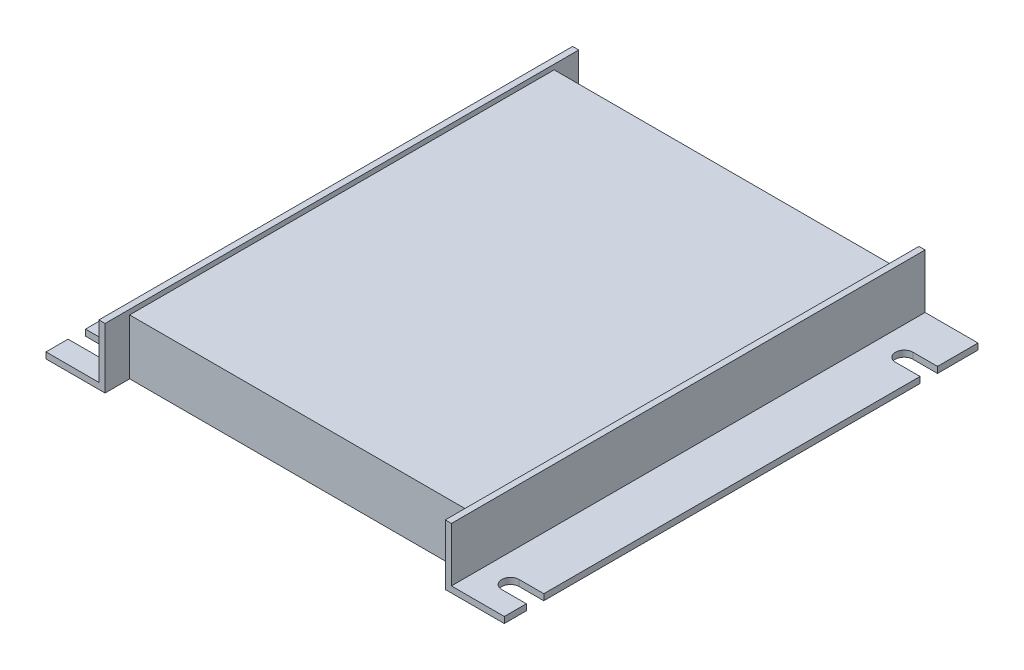
ISO-10303-21;
HEADER;
FILE_DESCRIPTION(('STEP AP214'),'2;1');
FILE_NAME('part.step','',(''),(''),'','','');
FILE_SCHEMA(('AUTOMOTIVE_DESIGN { 1 0 10303 214 1 1 1 1 }'));
ENDSEC;
DATA;
#1=APPLICATION_CONTEXT('core data for automotive mechanical design processes');
#2=APPLICATION_PROTOCOL_DEFINITION('international standard','automotive_design',2000,#1);
#3=PRODUCT_CONTEXT('',#1,'mechanical');
#4=PRODUCT('Part','Part','',(#3));
#5=PRODUCT_RELATED_PRODUCT_CATEGORY('part','',(#4));
#6=PRODUCT_DEFINITION_FORMATION('','',#4);
#7=PRODUCT_DEFINITION_CONTEXT('part definition',#1,'design');
#8=PRODUCT_DEFINITION('design','',#6,#7);
#9=PRODUCT_DEFINITION_SHAPE('','',#8);
#10=(LENGTH_UNIT() NAMED_UNIT(*) SI_UNIT(.MILLI.,.METRE.));
#11=(NAMED_UNIT(*) PLANE_ANGLE_UNIT() SI_UNIT($,.RADIAN.));
#12=(NAMED_UNIT(*) SI_UNIT($,.STERADIAN.) SOLID_ANGLE_UNIT());
#13=UNCERTAINTY_MEASURE_WITH_UNIT(LENGTH_MEASURE(1.E-05),#10,'distance_accuracy_value','');
#14=(GEOMETRIC_REPRESENTATION_CONTEXT(3) GLOBAL_UNCERTAINTY_ASSIGNED_CONTEXT((#13)) GLOBAL_UNIT_ASSIGNED_CONTEXT((#10,
#11,#12)) REPRESENTATION_CONTEXT('',''));
#15=CARTESIAN_POINT('',(0.,0.,0.));
#16=DIRECTION('',(0.,0.,1.));
#17=DIRECTION('',(1.,0.,0.));
#18=AXIS2_PLACEMENT_3D('',#15,#16,#17);
#19=CARTESIAN_POINT('',(0.,1.5875,0.));
#20=DIRECTION('',(1.,0.,0.));
#21=DIRECTION('',(0.,0.,-1.));
#22=AXIS2_PLACEMENT_3D('',#19,#20,#21);
#23=PLANE('',#22);
#24=DIRECTION('',(0.,0.,1.));
#25=VECTOR('',#24,1.);
#26=CARTESIAN_POINT('',(0.,0.,0.));
#27=LINE('',#26,#25);
#28=CARTESIAN_POINT('',(0.,0.,-107.2896));
#29=VERTEX_POINT('',#28);
#30=CARTESIAN_POINT('',(0.,0.,-10.1854));
#31=VERTEX_POINT('',#30);
#32=EDGE_CURVE('E339',#29,#31,#27,.T.);
#33=ORIENTED_EDGE('',*,*,#32,.T.);
#34=DIRECTION('',(0.,1.,0.));
#35=VECTOR('',#34,1.);
#36=CARTESIAN_POINT('',(0.,1.5875,-10.1854));
#37=LINE('',#36,#35);
#38=CARTESIAN_POINT('',(0.,1.5875,-10.1854));
#39=VERTEX_POINT('',#38);
#40=EDGE_CURVE('E438',#31,#39,#37,.T.);
#41=ORIENTED_EDGE('',*,*,#40,.T.);
#42=DIRECTION('',(0.,0.,1.));
#43=VECTOR('',#42,1.);
#44=CARTESIAN_POINT('',(0.,1.5875,0.));
#45=LINE('',#44,#43);
#46=CARTESIAN_POINT('',(0.,1.5875,-107.2896));
#47=VERTEX_POINT('',#46);
#48=EDGE_CURVE('E355',#47,#39,#45,.T.);
#49=ORIENTED_EDGE('',*,*,#48,.F.);
#50=DIRECTION('',(0.,-1.,0.));
#51=VECTOR('',#50,1.);
#52=CARTESIAN_POINT('',(0.,1.5875,-107.2896));
#53=LINE('',#52,#51);
#54=EDGE_CURVE('E412',#47,#29,#53,.T.);
#55=ORIENTED_EDGE('',*,*,#54,.T.);
#56=EDGE_LOOP('',(#33,#41,#49,#55));
#57=FACE_BOUND('',#56,.T.);
#58=ADVANCED_FACE('F39',(#57),#23,.F.);
#59=CARTESIAN_POINT('',(0.,1.5875,0.));
#60=DIRECTION('',(0.,0.,-1.));
#61=DIRECTION('',(-1.,0.,0.));
#62=AXIS2_PLACEMENT_3D('',#59,#60,#61);
#63=PLANE('',#62);
#64=DIRECTION('',(1.,0.,0.));
#65=VECTOR('',#64,1.);
#66=CARTESIAN_POINT('',(0.,0.,0.));
#67=LINE('',#66,#65);
#68=CARTESIAN_POINT('',(0.,0.,0.));
#69=VERTEX_POINT('',#68);
#70=CARTESIAN_POINT('',(15.24,0.,0.));
#71=VERTEX_POINT('',#70);
#72=EDGE_CURVE('E330',#69,#71,#67,.T.);
#73=ORIENTED_EDGE('',*,*,#72,.T.);
#74=DIRECTION('',(0.,-1.,0.));
#75=VECTOR('',#74,1.);
#76=CARTESIAN_POINT('',(15.24,15.5575,0.));
#77=LINE('',#76,#75);
#78=CARTESIAN_POINT('',(15.24,15.5575,0.));
#79=VERTEX_POINT('',#78);
#80=EDGE_CURVE('E374',#79,#71,#77,.T.);
#81=ORIENTED_EDGE('',*,*,#80,.F.);
#82=DIRECTION('',(1.,0.,0.));
#83=VECTOR('',#82,1.);
#84=CARTESIAN_POINT('',(15.24,15.5575,0.));
#85=LINE('',#84,#83);
#86=CARTESIAN_POINT('',(13.6525,15.5575,0.));
#87=VERTEX_POINT('',#86);
#88=EDGE_CURVE('E384',#87,#79,#85,.T.);
#89=ORIENTED_EDGE('',*,*,#88,.F.);
#90=DIRECTION('',(0.,-1.,0.));
#91=VECTOR('',#90,1.);
#92=CARTESIAN_POINT('',(13.6525,15.5575,0.));
#93=LINE('',#92,#91);
#94=CARTESIAN_POINT('',(13.6525,1.5875,0.));
#95=VERTEX_POINT('',#94);
#96=EDGE_CURVE('E371',#87,#95,#93,.T.);
#97=ORIENTED_EDGE('',*,*,#96,.T.);
#98=DIRECTION('',(1.,0.,0.));
#99=VECTOR('',#98,1.);
#100=CARTESIAN_POINT('',(0.,1.5875,0.));
#101=LINE('',#100,#99);
#102=CARTESIAN_POINT('',(0.,1.5875,0.));
#103=VERTEX_POINT('',#102);
#104=EDGE_CURVE('E348',#103,#95,#101,.T.);
#105=ORIENTED_EDGE('',*,*,#104,.F.);
#106=DIRECTION('',(0.,-1.,0.));
#107=VECTOR('',#106,1.);
#108=CARTESIAN_POINT('',(0.,1.5875,0.));
#109=LINE('',#108,#107);
#110=EDGE_CURVE('E301',#103,#69,#109,.T.);
#111=ORIENTED_EDGE('',*,*,#110,.T.);
#112=EDGE_LOOP('',(#73,#81,#89,#97,#105,#111));
#113=FACE_BOUND('',#112,.T.);
#114=ADVANCED_FACE('F530',(#113),#63,.F.);
#115=CARTESIAN_POINT('',(118.26875,1.5875,0.));
#116=DIRECTION('',(-1.,0.,0.));
#117=DIRECTION('',(0.,0.,1.));
#118=AXIS2_PLACEMENT_3D('',#115,#116,#117);
#119=PLANE('',#118);
#120=DIRECTION('',(0.,0.,-1.));
#121=VECTOR('',#120,1.);
#122=CARTESIAN_POINT('',(118.26875,1.5875,0.));
#123=LINE('',#122,#121);
#124=CARTESIAN_POINT('',(118.26875,1.5875,-111.7854));
#125=VERTEX_POINT('',#124);
#126=CARTESIAN_POINT('',(118.26875,1.5875,-122.2375));
#127=VERTEX_POINT('',#126);
#128=EDGE_CURVE('E326',#125,#127,#123,.T.);
#129=ORIENTED_EDGE('',*,*,#128,.F.);
#130=DIRECTION('',(0.,-1.,0.));
#131=VECTOR('',#130,1.);
#132=CARTESIAN_POINT('',(118.26875,1.5875,-111.7854));
#133=LINE('',#132,#131);
#134=CARTESIAN_POINT('',(118.26875,0.,-111.7854));
#135=VERTEX_POINT('',#134);
#136=EDGE_CURVE('E316',#125,#135,#133,.T.);
#137=ORIENTED_EDGE('',*,*,#136,.T.);
#138=DIRECTION('',(0.,0.,-1.));
#139=VECTOR('',#138,1.);
#140=CARTESIAN_POINT('',(118.26875,0.,0.));
#141=LINE('',#140,#139);
#142=CARTESIAN_POINT('',(118.26875,0.,-122.2375));
#143=VERTEX_POINT('',#142);
#144=EDGE_CURVE('E289',#135,#143,#141,.T.);
#145=ORIENTED_EDGE('',*,*,#144,.T.);
#146=DIRECTION('',(0.,-1.,0.));
#147=VECTOR('',#146,1.);
#148=CARTESIAN_POINT('',(118.26875,1.5875,-122.2375));
#149=LINE('',#148,#147);
#150=EDGE_CURVE('E294',#127,#143,#149,.T.);
#151=ORIENTED_EDGE('',*,*,#150,.F.);
#152=EDGE_LOOP('',(#129,#137,#145,#151));
#153=FACE_BOUND('',#152,.T.);
#154=ADVANCED_FACE('F324',(#153),#119,.F.);
#155=CARTESIAN_POINT('',(118.26875,0.,-10.1854));
#156=VERTEX_POINT('',#155);
#157=CARTESIAN_POINT('',(118.26875,0.,-107.2896));
#158=VERTEX_POINT('',#157);
#159=EDGE_CURVE('E287',#156,#158,#141,.T.);
#160=ORIENTED_EDGE('',*,*,#159,.T.);
#161=DIRECTION('',(0.,1.,0.));
#162=VECTOR('',#161,1.);
#163=CARTESIAN_POINT('',(118.26875,1.5875,-107.2896));
#164=LINE('',#163,#162);
#165=CARTESIAN_POINT('',(118.26875,1.5875,-107.2896));
#166=VERTEX_POINT('',#165);
#167=EDGE_CURVE('E62',#158,#166,#164,.T.);
#168=ORIENTED_EDGE('',*,*,#167,.T.);
#169=CARTESIAN_POINT('',(118.26875,1.5875,-10.1854));
#170=VERTEX_POINT('',#169);
#171=EDGE_CURVE('E347',#170,#166,#123,.T.);
#172=ORIENTED_EDGE('',*,*,#171,.F.);
#173=DIRECTION('',(0.,-1.,0.));
#174=VECTOR('',#173,1.);
#175=CARTESIAN_POINT('',(118.26875,1.5875,-10.1854));
#176=LINE('',#175,#174);
#177=EDGE_CURVE('E432',#170,#156,#176,.T.);
#178=ORIENTED_EDGE('',*,*,#177,.T.);
#179=EDGE_LOOP('',(#160,#168,#172,#178));
#180=FACE_BOUND('',#179,.T.);
#181=ADVANCED_FACE('F516',(#180),#119,.F.);
#182=CARTESIAN_POINT('',(0.,1.5875,-122.2375));
#183=DIRECTION('',(0.,0.,1.));
#184=DIRECTION('',(1.,0.,0.));
#185=AXIS2_PLACEMENT_3D('',#182,#183,#184);
#186=PLANE('',#185);
#187=DIRECTION('',(0.,-1.,0.));
#188=VECTOR('',#187,1.);
#189=CARTESIAN_POINT('',(15.24,15.5575,-122.2375));
#190=LINE('',#189,#188);
#191=CARTESIAN_POINT('',(15.24,15.5575,-122.2375));
#192=VERTEX_POINT('',#191);
#193=CARTESIAN_POINT('',(15.24,0.,-122.2375));
#194=VERTEX_POINT('',#193);
#195=EDGE_CURVE('E376',#192,#194,#190,.T.);
#196=ORIENTED_EDGE('',*,*,#195,.T.);
#197=DIRECTION('',(-1.,0.,0.));
#198=VECTOR('',#197,1.);
#199=CARTESIAN_POINT('',(0.,0.,-122.2375));
#200=LINE('',#199,#198);
#201=CARTESIAN_POINT('',(0.,0.,-122.2375));
#202=VERTEX_POINT('',#201);
#203=EDGE_CURVE('E274',#194,#202,#200,.T.);
#204=ORIENTED_EDGE('',*,*,#203,.T.);
#205=DIRECTION('',(0.,-1.,0.));
#206=VECTOR('',#205,1.);
#207=CARTESIAN_POINT('',(0.,1.5875,-122.2375));
#208=LINE('',#207,#206);
#209=CARTESIAN_POINT('',(0.,1.5875,-122.2375));
#210=VERTEX_POINT('',#209);
#211=EDGE_CURVE('E292',#210,#202,#208,.T.);
#212=ORIENTED_EDGE('',*,*,#211,.F.);
#213=DIRECTION('',(-1.,0.,0.));
#214=VECTOR('',#213,1.);
#215=CARTESIAN_POINT('',(0.,1.5875,-122.2375));
#216=LINE('',#215,#214);
#217=CARTESIAN_POINT('',(13.6525,1.5875,-122.2375));
#218=VERTEX_POINT('',#217);
#219=EDGE_CURVE('E343',#218,#210,#216,.T.);
#220=ORIENTED_EDGE('',*,*,#219,.F.);
#221=DIRECTION('',(0.,-1.,0.));
#222=VECTOR('',#221,1.);
#223=CARTESIAN_POINT('',(13.6525,15.5575,-122.2375));
#224=LINE('',#223,#222);
#225=CARTESIAN_POINT('',(13.6525,15.5575,-122.2375));
#226=VERTEX_POINT('',#225);
#227=EDGE_CURVE('E369',#226,#218,#224,.T.);
#228=ORIENTED_EDGE('',*,*,#227,.F.);
#229=DIRECTION('',(-1.,0.,0.));
#230=VECTOR('',#229,1.);
#231=CARTESIAN_POINT('',(13.6525,15.5575,-122.2375));
#232=LINE('',#231,#230);
#233=EDGE_CURVE('E381',#192,#226,#232,.T.);
#234=ORIENTED_EDGE('',*,*,#233,.F.);
#235=EDGE_LOOP('',(#196,#204,#212,#220,#228,#234));
#236=FACE_BOUND('',#235,.T.);
#237=ADVANCED_FACE('F539',(#236),#186,.F.);
#238=CARTESIAN_POINT('',(0.,0.,-111.7854));
#239=VERTEX_POINT('',#238);
#240=EDGE_CURVE('E277',#202,#239,#27,.T.);
#241=ORIENTED_EDGE('',*,*,#240,.T.);
#242=DIRECTION('',(0.,1.,0.));
#243=VECTOR('',#242,1.);
#244=CARTESIAN_POINT('',(0.,1.5875,-111.7854));
#245=LINE('',#244,#243);
#246=CARTESIAN_POINT('',(0.,1.5875,-111.7854));
#247=VERTEX_POINT('',#246);
#248=EDGE_CURVE('E402',#239,#247,#245,.T.);
#249=ORIENTED_EDGE('',*,*,#248,.T.);
#250=EDGE_CURVE('E352',#210,#247,#45,.T.);
#251=ORIENTED_EDGE('',*,*,#250,.F.);
#252=ORIENTED_EDGE('',*,*,#211,.T.);
#253=EDGE_LOOP('',(#241,#249,#251,#252));
#254=FACE_BOUND('',#253,.T.);
#255=ADVANCED_FACE('F532',(#254),#23,.F.);
#256=CARTESIAN_POINT('',(0.,1.5875,0.));
#257=DIRECTION('',(0.,-1.,0.));
#258=DIRECTION('',(0.,0.,-1.));
#259=AXIS2_PLACEMENT_3D('',#256,#257,#258);
#260=PLANE('',#259);
#261=CARTESIAN_POINT('',(111.91875,1.5875,-109.5375));
#262=DIRECTION('',(0.,1.,0.));
#263=DIRECTION('',(0.,0.,1.));
#264=AXIS2_PLACEMENT_3D('',#261,#262,#263);
#265=CIRCLE('',#264,2.2479);
#266=CARTESIAN_POINT('',(111.91875,1.5875,-111.7854));
#267=VERTEX_POINT('',#266);
#268=CARTESIAN_POINT('',(111.91875,1.5875,-107.2896));
#269=VERTEX_POINT('',#268);
#270=EDGE_CURVE('E472',#267,#269,#265,.T.);
#271=ORIENTED_EDGE('',*,*,#270,.F.);
#272=DIRECTION('',(-1.,0.,0.));
#273=VECTOR('',#272,1.);
#274=CARTESIAN_POINT('',(111.91875,1.5875,-111.7854));
#275=LINE('',#274,#273);
#276=EDGE_CURVE('E488',#125,#267,#275,.T.);
#277=ORIENTED_EDGE('',*,*,#276,.F.);
#278=ORIENTED_EDGE('',*,*,#128,.T.);
#279=CARTESIAN_POINT('',(104.61625,1.5875,-122.2375));
#280=VERTEX_POINT('',#279);
#281=EDGE_CURVE('E295',#127,#280,#216,.T.);
#282=ORIENTED_EDGE('',*,*,#281,.T.);
#283=DIRECTION('',(0.,0.,-1.));
#284=VECTOR('',#283,1.);
#285=CARTESIAN_POINT('',(104.61625,1.5875,-122.2375));
#286=LINE('',#285,#284);
#287=CARTESIAN_POINT('',(104.61625,1.5875,0.));
#288=VERTEX_POINT('',#287);
#289=EDGE_CURVE('E399',#288,#280,#286,.T.);
#290=ORIENTED_EDGE('',*,*,#289,.F.);
#291=CARTESIAN_POINT('',(118.26875,1.5875,0.));
#292=VERTEX_POINT('',#291);
#293=EDGE_CURVE('E351',#288,#292,#101,.T.);
#294=ORIENTED_EDGE('',*,*,#293,.T.);
#295=CARTESIAN_POINT('',(118.26875,1.5875,-5.6896));
#296=VERTEX_POINT('',#295);
#297=EDGE_CURVE('E344',#292,#296,#123,.T.);
#298=ORIENTED_EDGE('',*,*,#297,.T.);
#299=DIRECTION('',(1.,0.,0.));
#300=VECTOR('',#299,1.);
#301=CARTESIAN_POINT('',(111.918750000001,1.5875,-5.6896));
#302=LINE('',#301,#300);
#303=CARTESIAN_POINT('',(111.918750000001,1.5875,-5.6896));
#304=VERTEX_POINT('',#303);
#305=EDGE_CURVE('E476',#304,#296,#302,.T.);
#306=ORIENTED_EDGE('',*,*,#305,.F.);
#307=CARTESIAN_POINT('',(111.918750000001,1.5875,-7.9375));
#308=DIRECTION('',(0.,1.,0.));
#309=DIRECTION('',(0.,0.,1.));
#310=AXIS2_PLACEMENT_3D('',#307,#308,#309);
#311=CIRCLE('',#310,2.2479);
#312=CARTESIAN_POINT('',(111.918750000001,1.5875,-10.1854));
#313=VERTEX_POINT('',#312);
#314=EDGE_CURVE('E456',#313,#304,#311,.T.);
#315=ORIENTED_EDGE('',*,*,#314,.F.);
#316=DIRECTION('',(-1.,0.,0.));
#317=VECTOR('',#316,1.);
#318=CARTESIAN_POINT('',(111.918750000001,1.5875,-10.1854));
#319=LINE('',#318,#317);
#320=EDGE_CURVE('E473',#170,#313,#319,.T.);
#321=ORIENTED_EDGE('',*,*,#320,.F.);
#322=ORIENTED_EDGE('',*,*,#171,.T.);
#323=DIRECTION('',(1.,0.,0.));
#324=VECTOR('',#323,1.);
#325=CARTESIAN_POINT('',(111.91875,1.5875,-107.2896));
#326=LINE('',#325,#324);
#327=EDGE_CURVE('E491',#269,#166,#326,.T.);
#328=ORIENTED_EDGE('',*,*,#327,.F.);
#329=EDGE_LOOP('',(#271,#277,#278,#282,#290,#294,#298,#306,#315,#321,#322,#328));
#330=FACE_BOUND('',#329,.T.);
#331=ADVANCED_FACE('F508',(#330),#260,.F.);
#332=ORIENTED_EDGE('',*,*,#48,.T.);
#333=DIRECTION('',(-1.,0.,0.));
#334=VECTOR('',#333,1.);
#335=CARTESIAN_POINT('',(-8.73124999999891,1.5875,-10.1854));
#336=LINE('',#335,#334);
#337=CARTESIAN_POINT('',(8.73125000000104,1.5875,-10.1854));
#338=VERTEX_POINT('',#337);
#339=EDGE_CURVE('E457',#338,#39,#336,.T.);
#340=ORIENTED_EDGE('',*,*,#339,.F.);
#341=CARTESIAN_POINT('',(8.73125000000104,1.5875,-7.9375));
#342=DIRECTION('',(0.,1.,0.));
#343=DIRECTION('',(0.,0.,1.));
#344=AXIS2_PLACEMENT_3D('',#341,#342,#343);
#345=CIRCLE('',#344,2.2479);
#346=CARTESIAN_POINT('',(8.73125000000104,1.5875,-5.6896));
#347=VERTEX_POINT('',#346);
#348=EDGE_CURVE('E459',#347,#338,#345,.T.);
#349=ORIENTED_EDGE('',*,*,#348,.F.);
#350=DIRECTION('',(1.,0.,0.));
#351=VECTOR('',#350,1.);
#352=CARTESIAN_POINT('',(-8.73124999999891,1.5875,-5.6896));
#353=LINE('',#352,#351);
#354=CARTESIAN_POINT('',(0.,1.5875,-5.6896));
#355=VERTEX_POINT('',#354);
#356=EDGE_CURVE('E447',#355,#347,#353,.T.);
#357=ORIENTED_EDGE('',*,*,#356,.F.);
#358=EDGE_CURVE('E285',#355,#103,#45,.T.);
#359=ORIENTED_EDGE('',*,*,#358,.T.);
#360=ORIENTED_EDGE('',*,*,#104,.T.);
#361=DIRECTION('',(0.,0.,1.));
#362=VECTOR('',#361,1.);
#363=CARTESIAN_POINT('',(13.6525,1.5875,0.));
#364=LINE('',#363,#362);
#365=EDGE_CURVE('E379',#218,#95,#364,.T.);
#366=ORIENTED_EDGE('',*,*,#365,.F.);
#367=ORIENTED_EDGE('',*,*,#219,.T.);
#368=ORIENTED_EDGE('',*,*,#250,.T.);
#369=DIRECTION('',(-1.,0.,0.));
#370=VECTOR('',#369,1.);
#371=CARTESIAN_POINT('',(-8.73124999999997,1.5875,-111.7854));
#372=LINE('',#371,#370);
#373=CARTESIAN_POINT('',(8.73124999999997,1.5875,-111.7854));
#374=VERTEX_POINT('',#373);
#375=EDGE_CURVE('E421',#374,#247,#372,.T.);
#376=ORIENTED_EDGE('',*,*,#375,.F.);
#377=CARTESIAN_POINT('',(8.73124999999997,1.5875,-109.5375));
#378=DIRECTION('',(0.,1.,0.));
#379=DIRECTION('',(0.,0.,1.));
#380=AXIS2_PLACEMENT_3D('',#377,#378,#379);
#381=CIRCLE('',#380,2.2479);
#382=CARTESIAN_POINT('',(8.73124999999997,1.5875,-107.2896));
#383=VERTEX_POINT('',#382);
#384=EDGE_CURVE('E424',#383,#374,#381,.T.);
#385=ORIENTED_EDGE('',*,*,#384,.F.);
#386=DIRECTION('',(1.,0.,0.));
#387=VECTOR('',#386,1.);
#388=CARTESIAN_POINT('',(-8.73124999999997,1.5875,-107.2896));
#389=LINE('',#388,#387);
#390=EDGE_CURVE('E327',#47,#383,#389,.T.);
#391=ORIENTED_EDGE('',*,*,#390,.F.);
#392=EDGE_LOOP('',(#332,#340,#349,#357,#359,#360,#366,#367,#368,#376,#385,#391));
#393=FACE_BOUND('',#392,.T.);
#394=ADVANCED_FACE('F542',(#393),#260,.F.);
#395=ORIENTED_EDGE('',*,*,#358,.F.);
#396=DIRECTION('',(0.,-1.,0.));
#397=VECTOR('',#396,1.);
#398=CARTESIAN_POINT('',(0.,1.5875,-5.6896));
#399=LINE('',#398,#397);
#400=CARTESIAN_POINT('',(0.,0.,-5.6896));
#401=VERTEX_POINT('',#400);
#402=EDGE_CURVE('E441',#355,#401,#399,.T.);
#403=ORIENTED_EDGE('',*,*,#402,.T.);
#404=EDGE_CURVE('E340',#401,#69,#27,.T.);
#405=ORIENTED_EDGE('',*,*,#404,.T.);
#406=ORIENTED_EDGE('',*,*,#110,.F.);
#407=EDGE_LOOP('',(#395,#403,#405,#406));
#408=FACE_BOUND('',#407,.T.);
#409=ADVANCED_FACE('F41',(#408),#23,.F.);
#410=DIRECTION('',(0.,-1.,0.));
#411=VECTOR('',#410,1.);
#412=CARTESIAN_POINT('',(103.02875,15.5575,0.));
#413=LINE('',#412,#411);
#414=CARTESIAN_POINT('',(103.02875,15.5575,0.));
#415=VERTEX_POINT('',#414);
#416=CARTESIAN_POINT('',(103.02875,0.,0.));
#417=VERTEX_POINT('',#416);
#418=EDGE_CURVE('E396',#415,#417,#413,.T.);
#419=ORIENTED_EDGE('',*,*,#418,.T.);
#420=CARTESIAN_POINT('',(118.26875,0.,0.));
#421=VERTEX_POINT('',#420);
#422=EDGE_CURVE('E333',#417,#421,#67,.T.);
#423=ORIENTED_EDGE('',*,*,#422,.T.);
#424=DIRECTION('',(0.,-1.,0.));
#425=VECTOR('',#424,1.);
#426=CARTESIAN_POINT('',(118.26875,1.5875,0.));
#427=LINE('',#426,#425);
#428=EDGE_CURVE('E298',#292,#421,#427,.T.);
#429=ORIENTED_EDGE('',*,*,#428,.F.);
#430=ORIENTED_EDGE('',*,*,#293,.F.);
#431=DIRECTION('',(0.,-1.,0.));
#432=VECTOR('',#431,1.);
#433=CARTESIAN_POINT('',(104.61625,15.5575,0.));
#434=LINE('',#433,#432);
#435=CARTESIAN_POINT('',(104.61625,15.5575,0.));
#436=VERTEX_POINT('',#435);
#437=EDGE_CURVE('E382',#436,#288,#434,.T.);
#438=ORIENTED_EDGE('',*,*,#437,.F.);
#439=DIRECTION('',(1.,0.,0.));
#440=VECTOR('',#439,1.);
#441=CARTESIAN_POINT('',(104.61625,15.5575,0.));
#442=LINE('',#441,#440);
#443=EDGE_CURVE('E401',#415,#436,#442,.T.);
#444=ORIENTED_EDGE('',*,*,#443,.F.);
#445=EDGE_LOOP('',(#419,#423,#429,#430,#438,#444));
#446=FACE_BOUND('',#445,.T.);
#447=ADVANCED_FACE('F536',(#446),#63,.F.);
#448=CARTESIAN_POINT('',(118.26875,0.,-5.6896));
#449=VERTEX_POINT('',#448);
#450=EDGE_CURVE('E282',#421,#449,#141,.T.);
#451=ORIENTED_EDGE('',*,*,#450,.T.);
#452=DIRECTION('',(0.,1.,0.));
#453=VECTOR('',#452,1.);
#454=CARTESIAN_POINT('',(118.26875,1.5875,-5.6896));
#455=LINE('',#454,#453);
#456=EDGE_CURVE('E435',#449,#296,#455,.T.);
#457=ORIENTED_EDGE('',*,*,#456,.T.);
#458=ORIENTED_EDGE('',*,*,#297,.F.);
#459=ORIENTED_EDGE('',*,*,#428,.T.);
#460=EDGE_LOOP('',(#451,#457,#458,#459));
#461=FACE_BOUND('',#460,.T.);
#462=ADVANCED_FACE('F548',(#461),#119,.F.);
#463=CARTESIAN_POINT('',(103.02875,0.,-122.2375));
#464=VERTEX_POINT('',#463);
#465=EDGE_CURVE('E281',#143,#464,#200,.T.);
#466=ORIENTED_EDGE('',*,*,#465,.T.);
#467=DIRECTION('',(0.,-1.,0.));
#468=VECTOR('',#467,1.);
#469=CARTESIAN_POINT('',(103.02875,15.5575,-122.2375));
#470=LINE('',#469,#468);
#471=CARTESIAN_POINT('',(103.02875,15.5575,-122.2375));
#472=VERTEX_POINT('',#471);
#473=EDGE_CURVE('E394',#472,#464,#470,.T.);
#474=ORIENTED_EDGE('',*,*,#473,.F.);
#475=DIRECTION('',(-1.,0.,0.));
#476=VECTOR('',#475,1.);
#477=CARTESIAN_POINT('',(103.02875,15.5575,-122.2375));
#478=LINE('',#477,#476);
#479=CARTESIAN_POINT('',(104.61625,15.5575,-122.2375));
#480=VERTEX_POINT('',#479);
#481=EDGE_CURVE('E404',#480,#472,#478,.T.);
#482=ORIENTED_EDGE('',*,*,#481,.F.);
#483=DIRECTION('',(0.,-1.,0.));
#484=VECTOR('',#483,1.);
#485=CARTESIAN_POINT('',(104.61625,15.5575,-122.2375));
#486=LINE('',#485,#484);
#487=EDGE_CURVE('E391',#480,#280,#486,.T.);
#488=ORIENTED_EDGE('',*,*,#487,.T.);
#489=ORIENTED_EDGE('',*,*,#281,.F.);
#490=ORIENTED_EDGE('',*,*,#150,.T.);
#491=EDGE_LOOP('',(#466,#474,#482,#488,#489,#490));
#492=FACE_BOUND('',#491,.T.);
#493=ADVANCED_FACE('F500',(#492),#186,.F.);
#494=CARTESIAN_POINT('',(0.,0.,0.));
#495=DIRECTION('',(0.,-1.,0.));
#496=DIRECTION('',(0.,0.,-1.));
#497=AXIS2_PLACEMENT_3D('',#494,#495,#496);
#498=PLANE('',#497);
#499=DIRECTION('',(0.,0.,-1.));
#500=VECTOR('',#499,1.);
#501=CARTESIAN_POINT('',(15.24,0.,0.));
#502=LINE('',#501,#500);
#503=CARTESIAN_POINT('',(15.24,0.,-115.8875));
#504=VERTEX_POINT('',#503);
#505=EDGE_CURVE('E11',#504,#194,#502,.T.);
#506=ORIENTED_EDGE('',*,*,#505,.F.);
#507=DIRECTION('',(1.,0.,0.));
#508=VECTOR('',#507,1.);
#509=CARTESIAN_POINT('',(15.24,0.,-115.8875));
#510=LINE('',#509,#508);
#511=CARTESIAN_POINT('',(103.02875,0.,-115.8875));
#512=VERTEX_POINT('',#511);
#513=EDGE_CURVE('E264',#504,#512,#510,.T.);
#514=ORIENTED_EDGE('',*,*,#513,.T.);
#515=DIRECTION('',(0.,0.,-1.));
#516=VECTOR('',#515,1.);
#517=CARTESIAN_POINT('',(103.02875,0.,-115.8875));
#518=LINE('',#517,#516);
#519=EDGE_CURVE('E269',#512,#464,#518,.T.);
#520=ORIENTED_EDGE('',*,*,#519,.T.);
#521=ORIENTED_EDGE('',*,*,#465,.F.);
#522=ORIENTED_EDGE('',*,*,#144,.F.);
#523=DIRECTION('',(1.,0.,0.));
#524=VECTOR('',#523,1.);
#525=CARTESIAN_POINT('',(0.,0.,-111.7854));
#526=LINE('',#525,#524);
#527=CARTESIAN_POINT('',(111.91875,0.,-111.7854));
#528=VERTEX_POINT('',#527);
#529=EDGE_CURVE('E47',#528,#135,#526,.T.);
#530=ORIENTED_EDGE('',*,*,#529,.F.);
#531=CARTESIAN_POINT('',(111.91875,0.,-109.5375));
#532=DIRECTION('',(0.,1.,0.));
#533=DIRECTION('',(0.,0.,1.));
#534=AXIS2_PLACEMENT_3D('',#531,#532,#533);
#535=CIRCLE('',#534,2.2479);
#536=CARTESIAN_POINT('',(111.91875,0.,-107.2896));
#537=VERTEX_POINT('',#536);
#538=EDGE_CURVE('E490',#528,#537,#535,.T.);
#539=ORIENTED_EDGE('',*,*,#538,.T.);
#540=DIRECTION('',(1.,0.,0.));
#541=VECTOR('',#540,1.);
#542=CARTESIAN_POINT('',(111.91875,0.,-107.2896));
#543=LINE('',#542,#541);
#544=EDGE_CURVE('E486',#537,#158,#543,.T.);
#545=ORIENTED_EDGE('',*,*,#544,.T.);
#546=ORIENTED_EDGE('',*,*,#159,.F.);
#547=DIRECTION('',(1.,0.,0.));
#548=VECTOR('',#547,1.);
#549=CARTESIAN_POINT('',(0.,0.,-10.1854));
#550=LINE('',#549,#548);
#551=CARTESIAN_POINT('',(111.918750000001,0.,-10.1854));
#552=VERTEX_POINT('',#551);
#553=EDGE_CURVE('E311',#552,#156,#550,.T.);
#554=ORIENTED_EDGE('',*,*,#553,.F.);
#555=CARTESIAN_POINT('',(111.918750000001,0.,-7.9375));
#556=DIRECTION('',(0.,1.,0.));
#557=DIRECTION('',(0.,0.,1.));
#558=AXIS2_PLACEMENT_3D('',#555,#556,#557);
#559=CIRCLE('',#558,2.2479);
#560=CARTESIAN_POINT('',(111.918750000001,0.,-5.6896));
#561=VERTEX_POINT('',#560);
#562=EDGE_CURVE('E475',#552,#561,#559,.T.);
#563=ORIENTED_EDGE('',*,*,#562,.T.);
#564=DIRECTION('',(1.,0.,0.));
#565=VECTOR('',#564,1.);
#566=CARTESIAN_POINT('',(111.918750000001,0.,-5.6896));
#567=LINE('',#566,#565);
#568=EDGE_CURVE('E469',#561,#449,#567,.T.);
#569=ORIENTED_EDGE('',*,*,#568,.T.);
#570=ORIENTED_EDGE('',*,*,#450,.F.);
#571=ORIENTED_EDGE('',*,*,#422,.F.);
#572=DIRECTION('',(0.,0.,1.));
#573=VECTOR('',#572,1.);
#574=CARTESIAN_POINT('',(103.02875,0.,0.));
#575=LINE('',#574,#573);
#576=CARTESIAN_POINT('',(103.02875,0.,-6.34999999999999));
#577=VERTEX_POINT('',#576);
#578=EDGE_CURVE('E306',#577,#417,#575,.T.);
#579=ORIENTED_EDGE('',*,*,#578,.F.);
#580=DIRECTION('',(-1.,0.,0.));
#581=VECTOR('',#580,1.);
#582=CARTESIAN_POINT('',(15.24,0.,-6.34999999999999));
#583=LINE('',#582,#581);
#584=CARTESIAN_POINT('',(15.24,0.,-6.34999999999999));
#585=VERTEX_POINT('',#584);
#586=EDGE_CURVE('E444',#577,#585,#583,.T.);
#587=ORIENTED_EDGE('',*,*,#586,.T.);
#588=DIRECTION('',(0.,0.,1.));
#589=VECTOR('',#588,1.);
#590=CARTESIAN_POINT('',(15.24,0.,-6.34999999999999));
#591=LINE('',#590,#589);
#592=EDGE_CURVE('E448',#585,#71,#591,.T.);
#593=ORIENTED_EDGE('',*,*,#592,.T.);
#594=ORIENTED_EDGE('',*,*,#72,.F.);
#595=ORIENTED_EDGE('',*,*,#404,.F.);
#596=DIRECTION('',(-1.,0.,0.));
#597=VECTOR('',#596,1.);
#598=CARTESIAN_POINT('',(0.,0.,-5.6896));
#599=LINE('',#598,#597);
#600=CARTESIAN_POINT('',(8.73125000000104,0.,-5.6896));
#601=VERTEX_POINT('',#600);
#602=EDGE_CURVE('E309',#601,#401,#599,.T.);
#603=ORIENTED_EDGE('',*,*,#602,.F.);
#604=CARTESIAN_POINT('',(8.73125000000104,0.,-7.9375));
#605=DIRECTION('',(0.,1.,0.));
#606=DIRECTION('',(0.,0.,1.));
#607=AXIS2_PLACEMENT_3D('',#604,#605,#606);
#608=CIRCLE('',#607,2.2479);
#609=CARTESIAN_POINT('',(8.73125000000104,0.,-10.1854));
#610=VERTEX_POINT('',#609);
#611=EDGE_CURVE('E54',#601,#610,#608,.T.);
#612=ORIENTED_EDGE('',*,*,#611,.T.);
#613=DIRECTION('',(-1.,0.,0.));
#614=VECTOR('',#613,1.);
#615=CARTESIAN_POINT('',(-8.73124999999891,0.,-10.1854));
#616=LINE('',#615,#614);
#617=EDGE_CURVE('E454',#610,#31,#616,.T.);
#618=ORIENTED_EDGE('',*,*,#617,.T.);
#619=ORIENTED_EDGE('',*,*,#32,.F.);
#620=DIRECTION('',(-1.,0.,0.));
#621=VECTOR('',#620,1.);
#622=CARTESIAN_POINT('',(0.,0.,-107.2896));
#623=LINE('',#622,#621);
#624=CARTESIAN_POINT('',(8.73124999999997,0.,-107.2896));
#625=VERTEX_POINT('',#624);
#626=EDGE_CURVE('E304',#625,#29,#623,.T.);
#627=ORIENTED_EDGE('',*,*,#626,.F.);
#628=CARTESIAN_POINT('',(8.73124999999997,0.,-109.5375));
#629=DIRECTION('',(0.,1.,0.));
#630=DIRECTION('',(0.,0.,1.));
#631=AXIS2_PLACEMENT_3D('',#628,#629,#630);
#632=CIRCLE('',#631,2.2479);
#633=CARTESIAN_POINT('',(8.73124999999997,0.,-111.7854));
#634=VERTEX_POINT('',#633);
#635=EDGE_CURVE('E423',#625,#634,#632,.T.);
#636=ORIENTED_EDGE('',*,*,#635,.T.);
#637=DIRECTION('',(-1.,0.,0.));
#638=VECTOR('',#637,1.);
#639=CARTESIAN_POINT('',(-8.73124999999997,0.,-111.7854));
#640=LINE('',#639,#638);
#641=EDGE_CURVE('E419',#634,#239,#640,.T.);
#642=ORIENTED_EDGE('',*,*,#641,.T.);
#643=ORIENTED_EDGE('',*,*,#240,.F.);
#644=ORIENTED_EDGE('',*,*,#203,.F.);
#645=EDGE_LOOP('',(#506,#514,#520,#521,#522,#530,#539,#545,#546,#554,#563,#569,#570,#571,#579,
#587,#593,#594,#595,#603,#612,#618,#619,#627,#636,#642,#643,#644));
#646=FACE_BOUND('',#645,.T.);
#647=ADVANCED_FACE('F272',(#646),#498,.T.);
#648=CARTESIAN_POINT('',(15.24,14.2875,-6.35));
#649=DIRECTION('',(0.,0.,-1.));
#650=DIRECTION('',(-1.,0.,0.));
#651=AXIS2_PLACEMENT_3D('',#648,#649,#650);
#652=PLANE('',#651);
#653=DIRECTION('',(0.,-1.,0.));
#654=VECTOR('',#653,1.);
#655=CARTESIAN_POINT('',(15.24,14.2875,-6.35));
#656=LINE('',#655,#654);
#657=CARTESIAN_POINT('',(15.24,14.2875,-6.35));
#658=VERTEX_POINT('',#657);
#659=EDGE_CURVE('E356',#658,#585,#656,.T.);
#660=ORIENTED_EDGE('',*,*,#659,.T.);
#661=ORIENTED_EDGE('',*,*,#586,.F.);
#662=DIRECTION('',(0.,-1.,0.));
#663=VECTOR('',#662,1.);
#664=CARTESIAN_POINT('',(103.02875,14.2875,-6.34999999999999));
#665=LINE('',#664,#663);
#666=CARTESIAN_POINT('',(103.02875,14.2875,-6.34999999999999));
#667=VERTEX_POINT('',#666);
#668=EDGE_CURVE('E358',#667,#577,#665,.T.);
#669=ORIENTED_EDGE('',*,*,#668,.F.);
#670=DIRECTION('',(1.,0.,0.));
#671=VECTOR('',#670,1.);
#672=CARTESIAN_POINT('',(15.24,14.2875,-6.35));
#673=LINE('',#672,#671);
#674=EDGE_CURVE('E365',#658,#667,#673,.T.);
#675=ORIENTED_EDGE('',*,*,#674,.F.);
#676=EDGE_LOOP('',(#660,#661,#669,#675));
#677=FACE_BOUND('',#676,.T.);
#678=ADVANCED_FACE('F624',(#677),#652,.F.);
#679=CARTESIAN_POINT('',(15.24,14.2875,-115.8875));
#680=DIRECTION('',(0.,0.,1.));
#681=DIRECTION('',(1.,0.,0.));
#682=AXIS2_PLACEMENT_3D('',#679,#680,#681);
#683=PLANE('',#682);
#684=DIRECTION('',(0.,-1.,0.));
#685=VECTOR('',#684,1.);
#686=CARTESIAN_POINT('',(103.02875,14.2875,-115.8875));
#687=LINE('',#686,#685);
#688=CARTESIAN_POINT('',(103.02875,14.2875,-115.8875));
#689=VERTEX_POINT('',#688);
#690=EDGE_CURVE('E260',#689,#512,#687,.T.);
#691=ORIENTED_EDGE('',*,*,#690,.T.);
#692=ORIENTED_EDGE('',*,*,#513,.F.);
#693=DIRECTION('',(0.,-1.,0.));
#694=VECTOR('',#693,1.);
#695=CARTESIAN_POINT('',(15.24,14.2875,-115.8875));
#696=LINE('',#695,#694);
#697=CARTESIAN_POINT('',(15.24,14.2875,-115.8875));
#698=VERTEX_POINT('',#697);
#699=EDGE_CURVE('E249',#698,#504,#696,.T.);
#700=ORIENTED_EDGE('',*,*,#699,.F.);
#701=DIRECTION('',(-1.,0.,0.));
#702=VECTOR('',#701,1.);
#703=CARTESIAN_POINT('',(15.24,14.2875,-115.8875));
#704=LINE('',#703,#702);
#705=EDGE_CURVE('E261',#689,#698,#704,.T.);
#706=ORIENTED_EDGE('',*,*,#705,.F.);
#707=EDGE_LOOP('',(#691,#692,#700,#706));
#708=FACE_BOUND('',#707,.T.);
#709=ADVANCED_FACE('F265',(#708),#683,.F.);
#710=CARTESIAN_POINT('',(0.,14.2875,0.));
#711=DIRECTION('',(0.,1.,0.));
#712=DIRECTION('',(0.,0.,1.));
#713=AXIS2_PLACEMENT_3D('',#710,#711,#712);
#714=PLANE('',#713);
#715=DIRECTION('',(0.,0.,1.));
#716=VECTOR('',#715,1.);
#717=CARTESIAN_POINT('',(15.24,14.2875,-115.8875));
#718=LINE('',#717,#716);
#719=EDGE_CURVE('E256',#698,#658,#718,.T.);
#720=ORIENTED_EDGE('',*,*,#719,.T.);
#721=ORIENTED_EDGE('',*,*,#674,.T.);
#722=DIRECTION('',(0.,0.,-1.));
#723=VECTOR('',#722,1.);
#724=CARTESIAN_POINT('',(103.02875,14.2875,-115.8875));
#725=LINE('',#724,#723);
#726=EDGE_CURVE('E362',#667,#689,#725,.T.);
#727=ORIENTED_EDGE('',*,*,#726,.T.);
#728=ORIENTED_EDGE('',*,*,#705,.T.);
#729=EDGE_LOOP('',(#720,#721,#727,#728));
#730=FACE_BOUND('',#729,.T.);
#731=ADVANCED_FACE('F615',(#730),#714,.T.);
#732=CARTESIAN_POINT('',(15.24,15.5575,-122.2375));
#733=DIRECTION('',(-1.,0.,0.));
#734=DIRECTION('',(0.,0.,1.));
#735=AXIS2_PLACEMENT_3D('',#732,#733,#734);
#736=PLANE('',#735);
#737=ORIENTED_EDGE('',*,*,#80,.T.);
#738=ORIENTED_EDGE('',*,*,#592,.F.);
#739=ORIENTED_EDGE('',*,*,#659,.F.);
#740=ORIENTED_EDGE('',*,*,#719,.F.);
#741=ORIENTED_EDGE('',*,*,#699,.T.);
#742=ORIENTED_EDGE('',*,*,#505,.T.);
#743=ORIENTED_EDGE('',*,*,#195,.F.);
#744=DIRECTION('',(0.,0.,-1.));
#745=VECTOR('',#744,1.);
#746=CARTESIAN_POINT('',(15.24,15.5575,-122.2375));
#747=LINE('',#746,#745);
#748=EDGE_CURVE('E378',#79,#192,#747,.T.);
#749=ORIENTED_EDGE('',*,*,#748,.F.);
#750=EDGE_LOOP('',(#737,#738,#739,#740,#741,#742,#743,#749));
#751=FACE_BOUND('',#750,.T.);
#752=ADVANCED_FACE('F251',(#751),#736,.F.);
#753=CARTESIAN_POINT('',(13.6525,15.5575,0.));
#754=DIRECTION('',(1.,0.,0.));
#755=DIRECTION('',(0.,0.,-1.));
#756=AXIS2_PLACEMENT_3D('',#753,#754,#755);
#757=PLANE('',#756);
#758=ORIENTED_EDGE('',*,*,#365,.T.);
#759=ORIENTED_EDGE('',*,*,#96,.F.);
#760=DIRECTION('',(0.,0.,1.));
#761=VECTOR('',#760,1.);
#762=CARTESIAN_POINT('',(13.6525,15.5575,0.));
#763=LINE('',#762,#761);
#764=EDGE_CURVE('E386',#226,#87,#763,.T.);
#765=ORIENTED_EDGE('',*,*,#764,.F.);
#766=ORIENTED_EDGE('',*,*,#227,.T.);
#767=EDGE_LOOP('',(#758,#759,#765,#766));
#768=FACE_BOUND('',#767,.T.);
#769=ADVANCED_FACE('F611',(#768),#757,.F.);
#770=CARTESIAN_POINT('',(0.,15.5575,0.));
#771=DIRECTION('',(0.,-1.,0.));
#772=DIRECTION('',(0.,0.,-1.));
#773=AXIS2_PLACEMENT_3D('',#770,#771,#772);
#774=PLANE('',#773);
#775=ORIENTED_EDGE('',*,*,#233,.T.);
#776=ORIENTED_EDGE('',*,*,#764,.T.);
#777=ORIENTED_EDGE('',*,*,#88,.T.);
#778=ORIENTED_EDGE('',*,*,#748,.T.);
#779=EDGE_LOOP('',(#775,#776,#777,#778));
#780=FACE_BOUND('',#779,.T.);
#781=ADVANCED_FACE('F605',(#780),#774,.F.);
#782=CARTESIAN_POINT('',(103.02875,15.5575,0.));
#783=DIRECTION('',(1.,0.,0.));
#784=DIRECTION('',(0.,0.,-1.));
#785=AXIS2_PLACEMENT_3D('',#782,#783,#784);
#786=PLANE('',#785);
#787=ORIENTED_EDGE('',*,*,#726,.F.);
#788=ORIENTED_EDGE('',*,*,#668,.T.);
#789=ORIENTED_EDGE('',*,*,#578,.T.);
#790=ORIENTED_EDGE('',*,*,#418,.F.);
#791=DIRECTION('',(0.,0.,1.));
#792=VECTOR('',#791,1.);
#793=CARTESIAN_POINT('',(103.02875,15.5575,0.));
#794=LINE('',#793,#792);
#795=EDGE_CURVE('E398',#472,#415,#794,.T.);
#796=ORIENTED_EDGE('',*,*,#795,.F.);
#797=ORIENTED_EDGE('',*,*,#473,.T.);
#798=ORIENTED_EDGE('',*,*,#519,.F.);
#799=ORIENTED_EDGE('',*,*,#690,.F.);
#800=EDGE_LOOP('',(#787,#788,#789,#790,#796,#797,#798,#799));
#801=FACE_BOUND('',#800,.T.);
#802=ADVANCED_FACE('F602',(#801),#786,.F.);
#803=CARTESIAN_POINT('',(104.61625,15.5575,-122.2375));
#804=DIRECTION('',(-1.,0.,0.));
#805=DIRECTION('',(0.,0.,1.));
#806=AXIS2_PLACEMENT_3D('',#803,#804,#805);
#807=PLANE('',#806);
#808=ORIENTED_EDGE('',*,*,#289,.T.);
#809=ORIENTED_EDGE('',*,*,#487,.F.);
#810=DIRECTION('',(0.,0.,-1.));
#811=VECTOR('',#810,1.);
#812=CARTESIAN_POINT('',(104.61625,15.5575,-122.2375));
#813=LINE('',#812,#811);
#814=EDGE_CURVE('E406',#436,#480,#813,.T.);
#815=ORIENTED_EDGE('',*,*,#814,.F.);
#816=ORIENTED_EDGE('',*,*,#437,.T.);
#817=EDGE_LOOP('',(#808,#809,#815,#816));
#818=FACE_BOUND('',#817,.T.);
#819=ADVANCED_FACE('F600',(#818),#807,.F.);
#820=CARTESIAN_POINT('',(0.,15.5575,0.));
#821=DIRECTION('',(0.,-1.,0.));
#822=DIRECTION('',(0.,0.,-1.));
#823=AXIS2_PLACEMENT_3D('',#820,#821,#822);
#824=PLANE('',#823);
#825=ORIENTED_EDGE('',*,*,#443,.T.);
#826=ORIENTED_EDGE('',*,*,#814,.T.);
#827=ORIENTED_EDGE('',*,*,#481,.T.);
#828=ORIENTED_EDGE('',*,*,#795,.T.);
#829=EDGE_LOOP('',(#825,#826,#827,#828));
#830=FACE_BOUND('',#829,.T.);
#831=ADVANCED_FACE('F589',(#830),#824,.F.);
#832=CARTESIAN_POINT('',(-8.73124999999997,0.,-111.7854));
#833=DIRECTION('',(0.,0.,-1.));
#834=DIRECTION('',(-1.,0.,0.));
#835=AXIS2_PLACEMENT_3D('',#832,#833,#834);
#836=PLANE('',#835);
#837=ORIENTED_EDGE('',*,*,#641,.F.);
#838=DIRECTION('',(0.,1.,0.));
#839=VECTOR('',#838,1.);
#840=CARTESIAN_POINT('',(8.73124999999997,0.,-111.7854));
#841=LINE('',#840,#839);
#842=EDGE_CURVE('E415',#634,#374,#841,.T.);
#843=ORIENTED_EDGE('',*,*,#842,.T.);
#844=ORIENTED_EDGE('',*,*,#375,.T.);
#845=ORIENTED_EDGE('',*,*,#248,.F.);
#846=EDGE_LOOP('',(#837,#843,#844,#845));
#847=FACE_BOUND('',#846,.T.);
#848=ADVANCED_FACE('F585',(#847),#836,.F.);
#849=CARTESIAN_POINT('',(-8.73124999999997,0.,-107.2896));
#850=DIRECTION('',(0.,0.,1.));
#851=DIRECTION('',(1.,0.,0.));
#852=AXIS2_PLACEMENT_3D('',#849,#850,#851);
#853=PLANE('',#852);
#854=ORIENTED_EDGE('',*,*,#390,.T.);
#855=DIRECTION('',(0.,1.,0.));
#856=VECTOR('',#855,1.);
#857=CARTESIAN_POINT('',(8.73124999999997,0.,-107.2896));
#858=LINE('',#857,#856);
#859=EDGE_CURVE('E416',#625,#383,#858,.T.);
#860=ORIENTED_EDGE('',*,*,#859,.F.);
#861=ORIENTED_EDGE('',*,*,#626,.T.);
#862=ORIENTED_EDGE('',*,*,#54,.F.);
#863=EDGE_LOOP('',(#854,#860,#861,#862));
#864=FACE_BOUND('',#863,.T.);
#865=ADVANCED_FACE('F588',(#864),#853,.F.);
#866=CARTESIAN_POINT('',(8.73124999999997,0.,-109.5375));
#867=DIRECTION('',(0.,1.,0.));
#868=DIRECTION('',(0.,0.,1.));
#869=AXIS2_PLACEMENT_3D('',#866,#867,#868);
#870=CYLINDRICAL_SURFACE('',#869,2.2479);
#871=ORIENTED_EDGE('',*,*,#384,.T.);
#872=ORIENTED_EDGE('',*,*,#842,.F.);
#873=ORIENTED_EDGE('',*,*,#635,.F.);
#874=ORIENTED_EDGE('',*,*,#859,.T.);
#875=EDGE_LOOP('',(#871,#872,#873,#874));
#876=FACE_BOUND('',#875,.T.);
#877=ADVANCED_FACE('F591',(#876),#870,.F.);
#878=CARTESIAN_POINT('',(-8.73124999999891,0.,-10.1854));
#879=DIRECTION('',(0.,0.,-1.));
#880=DIRECTION('',(-1.,0.,0.));
#881=AXIS2_PLACEMENT_3D('',#878,#879,#880);
#882=PLANE('',#881);
#883=ORIENTED_EDGE('',*,*,#617,.F.);
#884=DIRECTION('',(0.,1.,0.));
#885=VECTOR('',#884,1.);
#886=CARTESIAN_POINT('',(8.73125000000104,0.,-10.1854));
#887=LINE('',#886,#885);
#888=EDGE_CURVE('E453',#610,#338,#887,.T.);
#889=ORIENTED_EDGE('',*,*,#888,.T.);
#890=ORIENTED_EDGE('',*,*,#339,.T.);
#891=ORIENTED_EDGE('',*,*,#40,.F.);
#892=EDGE_LOOP('',(#883,#889,#890,#891));
#893=FACE_BOUND('',#892,.T.);
#894=ADVANCED_FACE('F566',(#893),#882,.F.);
#895=CARTESIAN_POINT('',(-8.73124999999891,0.,-5.6896));
#896=DIRECTION('',(0.,0.,1.));
#897=DIRECTION('',(1.,0.,0.));
#898=AXIS2_PLACEMENT_3D('',#895,#896,#897);
#899=PLANE('',#898);
#900=ORIENTED_EDGE('',*,*,#356,.T.);
#901=DIRECTION('',(0.,1.,0.));
#902=VECTOR('',#901,1.);
#903=CARTESIAN_POINT('',(8.73125000000104,0.,-5.6896));
#904=LINE('',#903,#902);
#905=EDGE_CURVE('E451',#601,#347,#904,.T.);
#906=ORIENTED_EDGE('',*,*,#905,.F.);
#907=ORIENTED_EDGE('',*,*,#602,.T.);
#908=ORIENTED_EDGE('',*,*,#402,.F.);
#909=EDGE_LOOP('',(#900,#906,#907,#908));
#910=FACE_BOUND('',#909,.T.);
#911=ADVANCED_FACE('F570',(#910),#899,.F.);
#912=CARTESIAN_POINT('',(8.73125000000104,0.,-7.9375));
#913=DIRECTION('',(0.,1.,0.));
#914=DIRECTION('',(0.,0.,1.));
#915=AXIS2_PLACEMENT_3D('',#912,#913,#914);
#916=CYLINDRICAL_SURFACE('',#915,2.2479);
#917=ORIENTED_EDGE('',*,*,#348,.T.);
#918=ORIENTED_EDGE('',*,*,#888,.F.);
#919=ORIENTED_EDGE('',*,*,#611,.F.);
#920=ORIENTED_EDGE('',*,*,#905,.T.);
#921=EDGE_LOOP('',(#917,#918,#919,#920));
#922=FACE_BOUND('',#921,.T.);
#923=ADVANCED_FACE('F571',(#922),#916,.F.);
#924=CARTESIAN_POINT('',(111.918750000001,0.,-10.1854));
#925=DIRECTION('',(0.,0.,-1.));
#926=DIRECTION('',(-1.,0.,0.));
#927=AXIS2_PLACEMENT_3D('',#924,#925,#926);
#928=PLANE('',#927);
#929=ORIENTED_EDGE('',*,*,#320,.T.);
#930=DIRECTION('',(0.,1.,0.));
#931=VECTOR('',#930,1.);
#932=CARTESIAN_POINT('',(111.918750000001,0.,-10.1854));
#933=LINE('',#932,#931);
#934=EDGE_CURVE('E468',#552,#313,#933,.T.);
#935=ORIENTED_EDGE('',*,*,#934,.F.);
#936=ORIENTED_EDGE('',*,*,#553,.T.);
#937=ORIENTED_EDGE('',*,*,#177,.F.);
#938=EDGE_LOOP('',(#929,#935,#936,#937));
#939=FACE_BOUND('',#938,.T.);
#940=ADVANCED_FACE('F573',(#939),#928,.F.);
#941=CARTESIAN_POINT('',(111.918750000001,0.,-5.6896));
#942=DIRECTION('',(0.,0.,1.));
#943=DIRECTION('',(1.,0.,0.));
#944=AXIS2_PLACEMENT_3D('',#941,#942,#943);
#945=PLANE('',#944);
#946=ORIENTED_EDGE('',*,*,#568,.F.);
#947=DIRECTION('',(0.,1.,0.));
#948=VECTOR('',#947,1.);
#949=CARTESIAN_POINT('',(111.918750000001,0.,-5.6896));
#950=LINE('',#949,#948);
#951=EDGE_CURVE('E466',#561,#304,#950,.T.);
#952=ORIENTED_EDGE('',*,*,#951,.T.);
#953=ORIENTED_EDGE('',*,*,#305,.T.);
#954=ORIENTED_EDGE('',*,*,#456,.F.);
#955=EDGE_LOOP('',(#946,#952,#953,#954));
#956=FACE_BOUND('',#955,.T.);
#957=ADVANCED_FACE('F579',(#956),#945,.F.);
#958=CARTESIAN_POINT('',(111.918750000001,0.,-7.9375));
#959=DIRECTION('',(0.,1.,0.));
#960=DIRECTION('',(0.,0.,1.));
#961=AXIS2_PLACEMENT_3D('',#958,#959,#960);
#962=CYLINDRICAL_SURFACE('',#961,2.2479);
#963=ORIENTED_EDGE('',*,*,#314,.T.);
#964=ORIENTED_EDGE('',*,*,#951,.F.);
#965=ORIENTED_EDGE('',*,*,#562,.F.);
#966=ORIENTED_EDGE('',*,*,#934,.T.);
#967=EDGE_LOOP('',(#963,#964,#965,#966));
#968=FACE_BOUND('',#967,.T.);
#969=ADVANCED_FACE('F671',(#968),#962,.F.);
#970=CARTESIAN_POINT('',(111.91875,0.,-111.7854));
#971=DIRECTION('',(0.,0.,-1.));
#972=DIRECTION('',(-1.,0.,0.));
#973=AXIS2_PLACEMENT_3D('',#970,#971,#972);
#974=PLANE('',#973);
#975=ORIENTED_EDGE('',*,*,#276,.T.);
#976=DIRECTION('',(0.,1.,0.));
#977=VECTOR('',#976,1.);
#978=CARTESIAN_POINT('',(111.91875,0.,-111.7854));
#979=LINE('',#978,#977);
#980=EDGE_CURVE('E270',#528,#267,#979,.T.);
#981=ORIENTED_EDGE('',*,*,#980,.F.);
#982=ORIENTED_EDGE('',*,*,#529,.T.);
#983=ORIENTED_EDGE('',*,*,#136,.F.);
#984=EDGE_LOOP('',(#975,#981,#982,#983));
#985=FACE_BOUND('',#984,.T.);
#986=ADVANCED_FACE('F315',(#985),#974,.F.);
#987=CARTESIAN_POINT('',(111.91875,0.,-107.2896));
#988=DIRECTION('',(0.,0.,1.));
#989=DIRECTION('',(1.,0.,0.));
#990=AXIS2_PLACEMENT_3D('',#987,#988,#989);
#991=PLANE('',#990);
#992=ORIENTED_EDGE('',*,*,#544,.F.);
#993=DIRECTION('',(0.,1.,0.));
#994=VECTOR('',#993,1.);
#995=CARTESIAN_POINT('',(111.91875,0.,-107.2896));
#996=LINE('',#995,#994);
#997=EDGE_CURVE('E484',#537,#269,#996,.T.);
#998=ORIENTED_EDGE('',*,*,#997,.T.);
#999=ORIENTED_EDGE('',*,*,#327,.T.);
#1000=ORIENTED_EDGE('',*,*,#167,.F.);
#1001=EDGE_LOOP('',(#992,#998,#999,#1000));
#1002=FACE_BOUND('',#1001,.T.);
#1003=ADVANCED_FACE('F519',(#1002),#991,.F.);
#1004=CARTESIAN_POINT('',(111.91875,0.,-109.5375));
#1005=DIRECTION('',(0.,1.,0.));
#1006=DIRECTION('',(0.,0.,1.));
#1007=AXIS2_PLACEMENT_3D('',#1004,#1005,#1006);
#1008=CYLINDRICAL_SURFACE('',#1007,2.2479);
#1009=ORIENTED_EDGE('',*,*,#270,.T.);
#1010=ORIENTED_EDGE('',*,*,#997,.F.);
#1011=ORIENTED_EDGE('',*,*,#538,.F.);
#1012=ORIENTED_EDGE('',*,*,#980,.T.);
#1013=EDGE_LOOP('',(#1009,#1010,#1011,#1012));
#1014=FACE_BOUND('',#1013,.T.);
#1015=ADVANCED_FACE('F521',(#1014),#1008,.F.);
#1016=CLOSED_SHELL('',(#58,#114,#154,#181,#237,#255,#331,#394,#409,#447,#462,#493,#647,#678,
#709,#731,#752,#769,#781,#802,#819,#831,#848,#865,#877,#894,#911,#923,#940,#957,#969,#986,#1003,#1015));
#1017=MANIFOLD_SOLID_BREP('B2',#1016);
#1018=ADVANCED_BREP_SHAPE_REPRESENTATION('',(#18,#1017),#14);
#1019=SHAPE_DEFINITION_REPRESENTATION(#9,#1018);
ENDSEC;
END-ISO-10303-21;
